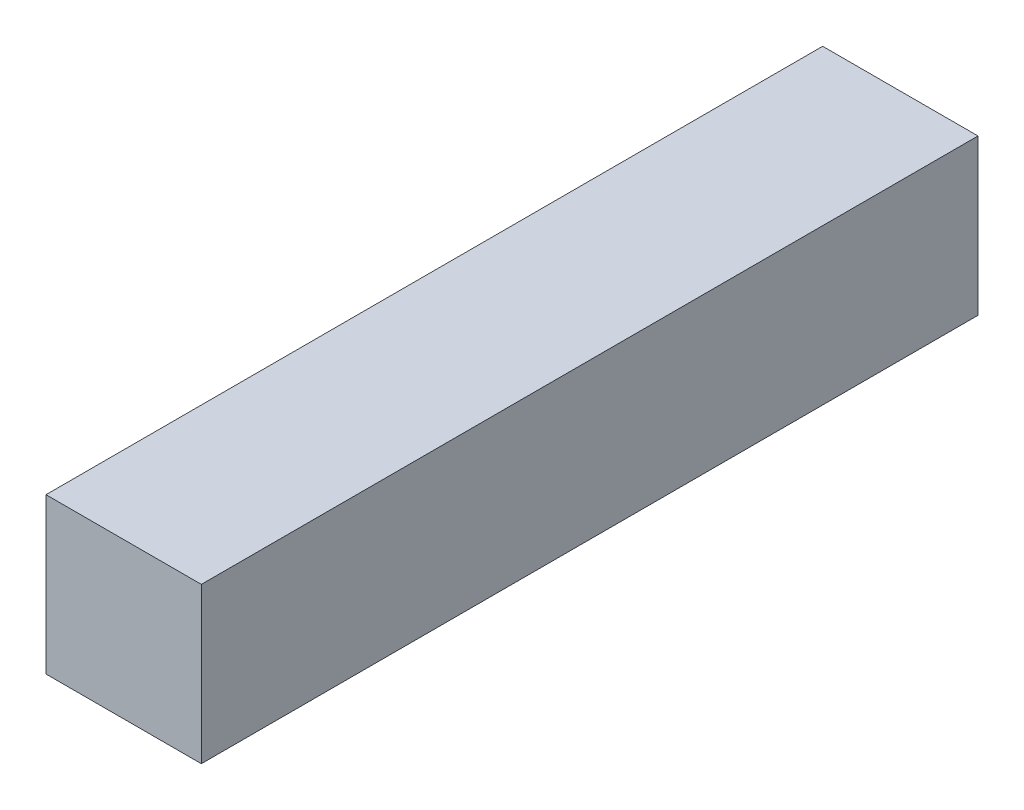
ISO-10303-21;
HEADER;
FILE_DESCRIPTION(('STEP AP214'),'2;1');
FILE_NAME('part.step','',(''),(''),'','','');
FILE_SCHEMA(('AUTOMOTIVE_DESIGN { 1 0 10303 214 1 1 1 1 }'));
ENDSEC;
DATA;
#1=APPLICATION_CONTEXT('core data for automotive mechanical design processes');
#2=APPLICATION_PROTOCOL_DEFINITION('international standard','automotive_design',2000,#1);
#3=PRODUCT_CONTEXT('',#1,'mechanical');
#4=PRODUCT('Part','Part','',(#3));
#5=PRODUCT_RELATED_PRODUCT_CATEGORY('part','',(#4));
#6=PRODUCT_DEFINITION_FORMATION('','',#4);
#7=PRODUCT_DEFINITION_CONTEXT('part definition',#1,'design');
#8=PRODUCT_DEFINITION('design','',#6,#7);
#9=PRODUCT_DEFINITION_SHAPE('','',#8);
#10=(LENGTH_UNIT() NAMED_UNIT(*) SI_UNIT(.MILLI.,.METRE.));
#11=(NAMED_UNIT(*) PLANE_ANGLE_UNIT() SI_UNIT($,.RADIAN.));
#12=(NAMED_UNIT(*) SI_UNIT($,.STERADIAN.) SOLID_ANGLE_UNIT());
#13=UNCERTAINTY_MEASURE_WITH_UNIT(LENGTH_MEASURE(1.E-05),#10,'distance_accuracy_value','');
#14=(GEOMETRIC_REPRESENTATION_CONTEXT(3) GLOBAL_UNCERTAINTY_ASSIGNED_CONTEXT((#13)) GLOBAL_UNIT_ASSIGNED_CONTEXT((#10,
#11,#12)) REPRESENTATION_CONTEXT('',''));
#15=CARTESIAN_POINT('',(0.,0.,0.));
#16=DIRECTION('',(0.,0.,1.));
#17=DIRECTION('',(1.,0.,0.));
#18=AXIS2_PLACEMENT_3D('',#15,#16,#17);
#19=CARTESIAN_POINT('',(2.,0.,0.));
#20=DIRECTION('',(1.,0.,0.));
#21=DIRECTION('',(0.,0.,-1.));
#22=AXIS2_PLACEMENT_3D('',#19,#20,#21);
#23=PLANE('',#22);
#24=DIRECTION('',(0.,1.,0.));
#25=VECTOR('',#24,1.);
#26=CARTESIAN_POINT('',(2.,1.,0.));
#27=LINE('',#26,#25);
#28=CARTESIAN_POINT('',(2.,0.,0.));
#29=VERTEX_POINT('',#28);
#30=CARTESIAN_POINT('',(2.,2.,0.));
#31=VERTEX_POINT('',#30);
#32=EDGE_CURVE('E55',#29,#31,#27,.T.);
#33=ORIENTED_EDGE('',*,*,#32,.T.);
#34=DIRECTION('',(0.,0.,1.));
#35=VECTOR('',#34,1.);
#36=CARTESIAN_POINT('',(2.,2.,0.));
#37=LINE('',#36,#35);
#38=CARTESIAN_POINT('',(2.,2.,10.));
#39=VERTEX_POINT('',#38);
#40=EDGE_CURVE('E67',#39,#31,#37,.F.);
#41=ORIENTED_EDGE('',*,*,#40,.F.);
#42=DIRECTION('',(0.,1.,0.));
#43=VECTOR('',#42,1.);
#44=CARTESIAN_POINT('',(2.,1.,10.));
#45=LINE('',#44,#43);
#46=CARTESIAN_POINT('',(2.,0.,10.));
#47=VERTEX_POINT('',#46);
#48=EDGE_CURVE('E20',#47,#39,#45,.T.);
#49=ORIENTED_EDGE('',*,*,#48,.F.);
#50=DIRECTION('',(0.,0.,1.));
#51=VECTOR('',#50,1.);
#52=CARTESIAN_POINT('',(2.,0.,0.));
#53=LINE('',#52,#51);
#54=EDGE_CURVE('E81',#29,#47,#53,.T.);
#55=ORIENTED_EDGE('',*,*,#54,.F.);
#56=EDGE_LOOP('',(#33,#41,#49,#55));
#57=FACE_BOUND('',#56,.T.);
#58=ADVANCED_FACE('F17',(#57),#23,.T.);
#59=CARTESIAN_POINT('',(1.,1.,10.));
#60=DIRECTION('',(0.,0.,1.));
#61=DIRECTION('',(1.,0.,0.));
#62=AXIS2_PLACEMENT_3D('',#59,#60,#61);
#63=PLANE('',#62);
#64=DIRECTION('',(1.,0.,0.));
#65=VECTOR('',#64,1.);
#66=CARTESIAN_POINT('',(0.,0.,10.));
#67=LINE('',#66,#65);
#68=CARTESIAN_POINT('',(0.,0.,10.));
#69=VERTEX_POINT('',#68);
#70=EDGE_CURVE('E65',#47,#69,#67,.F.);
#71=ORIENTED_EDGE('',*,*,#70,.F.);
#72=ORIENTED_EDGE('',*,*,#48,.T.);
#73=DIRECTION('',(-1.,0.,0.));
#74=VECTOR('',#73,1.);
#75=CARTESIAN_POINT('',(2.,2.,10.));
#76=LINE('',#75,#74);
#77=CARTESIAN_POINT('',(0.,2.,10.));
#78=VERTEX_POINT('',#77);
#79=EDGE_CURVE('E62',#78,#39,#76,.F.);
#80=ORIENTED_EDGE('',*,*,#79,.F.);
#81=DIRECTION('',(0.,-1.,0.));
#82=VECTOR('',#81,1.);
#83=CARTESIAN_POINT('',(0.,2.,10.));
#84=LINE('',#83,#82);
#85=EDGE_CURVE('E83',#69,#78,#84,.F.);
#86=ORIENTED_EDGE('',*,*,#85,.F.);
#87=EDGE_LOOP('',(#71,#72,#80,#86));
#88=FACE_BOUND('',#87,.T.);
#89=ADVANCED_FACE('F60',(#88),#63,.T.);
#90=CARTESIAN_POINT('',(2.,2.,0.));
#91=DIRECTION('',(0.,1.,0.));
#92=DIRECTION('',(-1.,0.,0.));
#93=AXIS2_PLACEMENT_3D('',#90,#91,#92);
#94=PLANE('',#93);
#95=DIRECTION('',(1.,0.,0.));
#96=VECTOR('',#95,1.);
#97=CARTESIAN_POINT('',(1.,2.,0.));
#98=LINE('',#97,#96);
#99=CARTESIAN_POINT('',(0.,2.,0.));
#100=VERTEX_POINT('',#99);
#101=EDGE_CURVE('E77',#31,#100,#98,.F.);
#102=ORIENTED_EDGE('',*,*,#101,.T.);
#103=DIRECTION('',(0.,0.,1.));
#104=VECTOR('',#103,1.);
#105=CARTESIAN_POINT('',(0.,2.,0.));
#106=LINE('',#105,#104);
#107=EDGE_CURVE('E73',#78,#100,#106,.F.);
#108=ORIENTED_EDGE('',*,*,#107,.F.);
#109=ORIENTED_EDGE('',*,*,#79,.T.);
#110=ORIENTED_EDGE('',*,*,#40,.T.);
#111=EDGE_LOOP('',(#102,#108,#109,#110));
#112=FACE_BOUND('',#111,.T.);
#113=ADVANCED_FACE('F71',(#112),#94,.T.);
#114=CARTESIAN_POINT('',(1.,1.,0.));
#115=DIRECTION('',(0.,0.,1.));
#116=DIRECTION('',(1.,0.,0.));
#117=AXIS2_PLACEMENT_3D('',#114,#115,#116);
#118=PLANE('',#117);
#119=ORIENTED_EDGE('',*,*,#101,.F.);
#120=ORIENTED_EDGE('',*,*,#32,.F.);
#121=DIRECTION('',(1.,0.,0.));
#122=VECTOR('',#121,1.);
#123=CARTESIAN_POINT('',(0.,0.,0.));
#124=LINE('',#123,#122);
#125=CARTESIAN_POINT('',(0.,0.,0.));
#126=VERTEX_POINT('',#125);
#127=EDGE_CURVE('E35',#126,#29,#124,.T.);
#128=ORIENTED_EDGE('',*,*,#127,.F.);
#129=DIRECTION('',(0.,-1.,0.));
#130=VECTOR('',#129,1.);
#131=CARTESIAN_POINT('',(0.,2.,0.));
#132=LINE('',#131,#130);
#133=EDGE_CURVE('E26',#100,#126,#132,.T.);
#134=ORIENTED_EDGE('',*,*,#133,.F.);
#135=EDGE_LOOP('',(#119,#120,#128,#134));
#136=FACE_BOUND('',#135,.T.);
#137=ADVANCED_FACE('F89',(#136),#118,.F.);
#138=CARTESIAN_POINT('',(0.,0.,0.));
#139=DIRECTION('',(0.,-1.,0.));
#140=DIRECTION('',(1.,0.,0.));
#141=AXIS2_PLACEMENT_3D('',#138,#139,#140);
#142=PLANE('',#141);
#143=ORIENTED_EDGE('',*,*,#127,.T.);
#144=ORIENTED_EDGE('',*,*,#54,.T.);
#145=ORIENTED_EDGE('',*,*,#70,.T.);
#146=DIRECTION('',(0.,0.,1.));
#147=VECTOR('',#146,1.);
#148=CARTESIAN_POINT('',(0.,0.,0.));
#149=LINE('',#148,#147);
#150=EDGE_CURVE('E11',#126,#69,#149,.T.);
#151=ORIENTED_EDGE('',*,*,#150,.F.);
#152=EDGE_LOOP('',(#143,#144,#145,#151));
#153=FACE_BOUND('',#152,.T.);
#154=ADVANCED_FACE('F91',(#153),#142,.T.);
#155=CARTESIAN_POINT('',(0.,2.,0.));
#156=DIRECTION('',(-1.,0.,0.));
#157=DIRECTION('',(0.,-1.,0.));
#158=AXIS2_PLACEMENT_3D('',#155,#156,#157);
#159=PLANE('',#158);
#160=ORIENTED_EDGE('',*,*,#133,.T.);
#161=ORIENTED_EDGE('',*,*,#150,.T.);
#162=ORIENTED_EDGE('',*,*,#85,.T.);
#163=ORIENTED_EDGE('',*,*,#107,.T.);
#164=EDGE_LOOP('',(#160,#161,#162,#163));
#165=FACE_BOUND('',#164,.T.);
#166=ADVANCED_FACE('F88',(#165),#159,.T.);
#167=CLOSED_SHELL('',(#58,#89,#113,#137,#154,#166));
#168=MANIFOLD_SOLID_BREP('B1',#167);
#169=ADVANCED_BREP_SHAPE_REPRESENTATION('',(#18,#168),#14);
#170=SHAPE_DEFINITION_REPRESENTATION(#9,#169);
ENDSEC;
END-ISO-10303-21;
